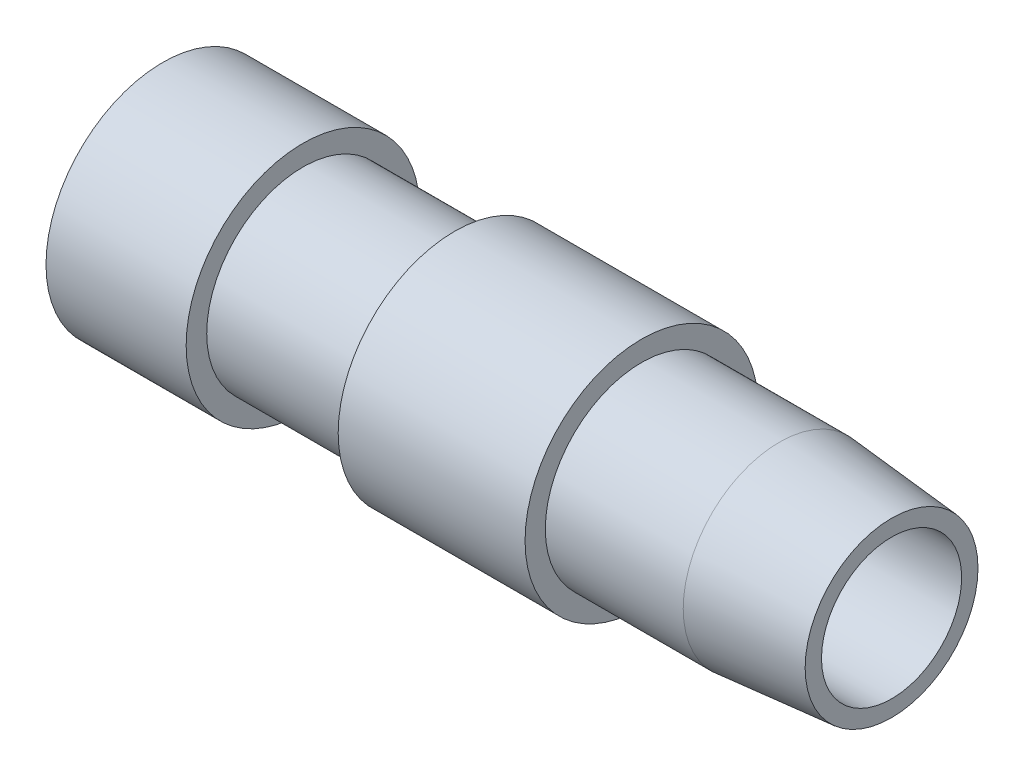
ISO-10303-21;
HEADER;
FILE_DESCRIPTION(('STEP AP214'),'2;1');
FILE_NAME('part.step','',(''),(''),'','','');
FILE_SCHEMA(('AUTOMOTIVE_DESIGN { 1 0 10303 214 1 1 1 1 }'));
ENDSEC;
DATA;
#1=APPLICATION_CONTEXT('core data for automotive mechanical design processes');
#2=APPLICATION_PROTOCOL_DEFINITION('international standard','automotive_design',2000,#1);
#3=PRODUCT_CONTEXT('',#1,'mechanical');
#4=PRODUCT('Part','Part','',(#3));
#5=PRODUCT_RELATED_PRODUCT_CATEGORY('part','',(#4));
#6=PRODUCT_DEFINITION_FORMATION('','',#4);
#7=PRODUCT_DEFINITION_CONTEXT('part definition',#1,'design');
#8=PRODUCT_DEFINITION('design','',#6,#7);
#9=PRODUCT_DEFINITION_SHAPE('','',#8);
#10=(LENGTH_UNIT() NAMED_UNIT(*) SI_UNIT(.MILLI.,.METRE.));
#11=(NAMED_UNIT(*) PLANE_ANGLE_UNIT() SI_UNIT($,.RADIAN.));
#12=(NAMED_UNIT(*) SI_UNIT($,.STERADIAN.) SOLID_ANGLE_UNIT());
#13=UNCERTAINTY_MEASURE_WITH_UNIT(LENGTH_MEASURE(1.E-05),#10,'distance_accuracy_value','');
#14=(GEOMETRIC_REPRESENTATION_CONTEXT(3) GLOBAL_UNCERTAINTY_ASSIGNED_CONTEXT((#13)) GLOBAL_UNIT_ASSIGNED_CONTEXT((#10,
#11,#12)) REPRESENTATION_CONTEXT('',''));
#15=CARTESIAN_POINT('',(0.,0.,0.));
#16=DIRECTION('',(0.,0.,1.));
#17=DIRECTION('',(1.,0.,0.));
#18=AXIS2_PLACEMENT_3D('',#15,#16,#17);
#19=CARTESIAN_POINT('',(0.,0.,0.));
#20=DIRECTION('',(-1.,0.,0.));
#21=DIRECTION('',(0.,0.,1.));
#22=AXIS2_PLACEMENT_3D('',#19,#20,#21);
#23=CYLINDRICAL_SURFACE('',#22,7.9375);
#24=CARTESIAN_POINT('',(0.,0.,0.));
#25=DIRECTION('',(-1.,0.,0.));
#26=DIRECTION('',(0.,0.,1.));
#27=AXIS2_PLACEMENT_3D('',#24,#25,#26);
#28=CIRCLE('',#27,7.9375);
#29=CARTESIAN_POINT('',(0.,0.,7.9375));
#30=VERTEX_POINT('',#29);
#31=EDGE_CURVE('E181',#30,#30,#28,.T.);
#32=ORIENTED_EDGE('',*,*,#31,.F.);
#33=EDGE_LOOP('',(#32));
#34=FACE_BOUND('',#33,.T.);
#35=CARTESIAN_POINT('',(9.525,0.,0.));
#36=DIRECTION('',(-1.,0.,0.));
#37=DIRECTION('',(0.,0.,1.));
#38=AXIS2_PLACEMENT_3D('',#35,#36,#37);
#39=CIRCLE('',#38,7.9375);
#40=CARTESIAN_POINT('',(9.525,0.,7.9375));
#41=VERTEX_POINT('',#40);
#42=EDGE_CURVE('E222',#41,#41,#39,.T.);
#43=ORIENTED_EDGE('',*,*,#42,.T.);
#44=EDGE_LOOP('',(#43));
#45=FACE_BOUND('',#44,.T.);
#46=ADVANCED_FACE('F44',(#34,#45),#23,.T.);
#47=CARTESIAN_POINT('',(9.525,7.9375,0.));
#48=DIRECTION('',(-1.,0.,0.));
#49=DIRECTION('',(0.,0.,1.));
#50=AXIS2_PLACEMENT_3D('',#47,#48,#49);
#51=PLANE('',#50);
#52=ORIENTED_EDGE('',*,*,#42,.F.);
#53=EDGE_LOOP('',(#52));
#54=FACE_BOUND('',#53,.T.);
#55=CARTESIAN_POINT('',(9.525,0.,0.));
#56=DIRECTION('',(-1.,0.,0.));
#57=DIRECTION('',(0.,0.,1.));
#58=AXIS2_PLACEMENT_3D('',#55,#56,#57);
#59=CIRCLE('',#58,6.5405);
#60=CARTESIAN_POINT('',(9.525,0.,6.5405));
#61=VERTEX_POINT('',#60);
#62=EDGE_CURVE('E218',#61,#61,#59,.T.);
#63=ORIENTED_EDGE('',*,*,#62,.T.);
#64=EDGE_LOOP('',(#63));
#65=FACE_BOUND('',#64,.T.);
#66=ADVANCED_FACE('F333',(#54,#65),#51,.F.);
#67=CARTESIAN_POINT('',(0.,0.,0.));
#68=DIRECTION('',(-1.,0.,0.));
#69=DIRECTION('',(0.,0.,1.));
#70=AXIS2_PLACEMENT_3D('',#67,#68,#69);
#71=CYLINDRICAL_SURFACE('',#70,6.5405);
#72=ORIENTED_EDGE('',*,*,#62,.F.);
#73=EDGE_LOOP('',(#72));
#74=FACE_BOUND('',#73,.T.);
#75=CARTESIAN_POINT('',(19.8374,0.,0.));
#76=DIRECTION('',(-1.,0.,0.));
#77=DIRECTION('',(0.,0.,1.));
#78=AXIS2_PLACEMENT_3D('',#75,#76,#77);
#79=CIRCLE('',#78,6.5405);
#80=CARTESIAN_POINT('',(19.8374,0.,6.5405));
#81=VERTEX_POINT('',#80);
#82=EDGE_CURVE('E214',#81,#81,#79,.T.);
#83=ORIENTED_EDGE('',*,*,#82,.T.);
#84=EDGE_LOOP('',(#83));
#85=FACE_BOUND('',#84,.T.);
#86=ADVANCED_FACE('F338',(#74,#85),#71,.T.);
#87=CARTESIAN_POINT('',(19.8374,6.5405,0.));
#88=DIRECTION('',(1.,0.,0.));
#89=DIRECTION('',(0.,0.,-1.));
#90=AXIS2_PLACEMENT_3D('',#87,#88,#89);
#91=PLANE('',#90);
#92=ORIENTED_EDGE('',*,*,#82,.F.);
#93=EDGE_LOOP('',(#92));
#94=FACE_BOUND('',#93,.T.);
#95=CARTESIAN_POINT('',(19.8374,0.,0.));
#96=DIRECTION('',(-1.,0.,0.));
#97=DIRECTION('',(0.,0.,1.));
#98=AXIS2_PLACEMENT_3D('',#95,#96,#97);
#99=CIRCLE('',#98,7.91718);
#100=CARTESIAN_POINT('',(19.8374,0.,7.91718));
#101=VERTEX_POINT('',#100);
#102=EDGE_CURVE('E210',#101,#101,#99,.T.);
#103=ORIENTED_EDGE('',*,*,#102,.T.);
#104=EDGE_LOOP('',(#103));
#105=FACE_BOUND('',#104,.T.);
#106=ADVANCED_FACE('F348',(#94,#105),#91,.F.);
#107=CARTESIAN_POINT('',(0.,0.,0.));
#108=DIRECTION('',(-1.,0.,0.));
#109=DIRECTION('',(0.,0.,1.));
#110=AXIS2_PLACEMENT_3D('',#107,#108,#109);
#111=CYLINDRICAL_SURFACE('',#110,7.91718);
#112=ORIENTED_EDGE('',*,*,#102,.F.);
#113=EDGE_LOOP('',(#112));
#114=FACE_BOUND('',#113,.T.);
#115=CARTESIAN_POINT('',(32.5374,0.,0.));
#116=DIRECTION('',(-1.,0.,0.));
#117=DIRECTION('',(0.,0.,1.));
#118=AXIS2_PLACEMENT_3D('',#115,#116,#117);
#119=CIRCLE('',#118,7.91718);
#120=CARTESIAN_POINT('',(32.5374,0.,7.91718));
#121=VERTEX_POINT('',#120);
#122=EDGE_CURVE('E206',#121,#121,#119,.T.);
#123=ORIENTED_EDGE('',*,*,#122,.T.);
#124=EDGE_LOOP('',(#123));
#125=FACE_BOUND('',#124,.T.);
#126=ADVANCED_FACE('F354',(#114,#125),#111,.T.);
#127=CARTESIAN_POINT('',(32.5374,7.91718,0.));
#128=DIRECTION('',(-1.,0.,0.));
#129=DIRECTION('',(0.,0.,1.));
#130=AXIS2_PLACEMENT_3D('',#127,#128,#129);
#131=PLANE('',#130);
#132=ORIENTED_EDGE('',*,*,#122,.F.);
#133=EDGE_LOOP('',(#132));
#134=FACE_BOUND('',#133,.T.);
#135=CARTESIAN_POINT('',(32.5374,0.,0.));
#136=DIRECTION('',(-1.,0.,0.));
#137=DIRECTION('',(0.,0.,1.));
#138=AXIS2_PLACEMENT_3D('',#135,#136,#137);
#139=CIRCLE('',#138,6.5405);
#140=CARTESIAN_POINT('',(32.5374,0.,6.5405));
#141=VERTEX_POINT('',#140);
#142=EDGE_CURVE('E202',#141,#141,#139,.T.);
#143=ORIENTED_EDGE('',*,*,#142,.T.);
#144=EDGE_LOOP('',(#143));
#145=FACE_BOUND('',#144,.T.);
#146=ADVANCED_FACE('F360',(#134,#145),#131,.F.);
#147=CARTESIAN_POINT('',(0.,0.,0.));
#148=DIRECTION('',(-1.,0.,0.));
#149=DIRECTION('',(0.,0.,1.));
#150=AXIS2_PLACEMENT_3D('',#147,#148,#149);
#151=CYLINDRICAL_SURFACE('',#150,6.5405);
#152=ORIENTED_EDGE('',*,*,#142,.F.);
#153=EDGE_LOOP('',(#152));
#154=FACE_BOUND('',#153,.T.);
#155=CARTESIAN_POINT('',(41.91,0.,0.));
#156=DIRECTION('',(-1.,0.,0.));
#157=DIRECTION('',(0.,0.,1.));
#158=AXIS2_PLACEMENT_3D('',#155,#156,#157);
#159=CIRCLE('',#158,6.5405);
#160=CARTESIAN_POINT('',(41.91,0.,6.5405));
#161=VERTEX_POINT('',#160);
#162=EDGE_CURVE('E198',#161,#161,#159,.T.);
#163=ORIENTED_EDGE('',*,*,#162,.T.);
#164=EDGE_LOOP('',(#163));
#165=FACE_BOUND('',#164,.T.);
#166=ADVANCED_FACE('F366',(#154,#165),#151,.T.);
#167=CARTESIAN_POINT('',(49.53,0.,0.));
#168=DIRECTION('',(-1.,0.,0.));
#169=DIRECTION('',(0.,0.,1.));
#170=AXIS2_PLACEMENT_3D('',#167,#168,#169);
#171=CONICAL_SURFACE('',#170,5.87383638393251,0.0872664625997096);
#172=ORIENTED_EDGE('',*,*,#162,.F.);
#173=EDGE_LOOP('',(#172));
#174=FACE_BOUND('',#173,.T.);
#175=CARTESIAN_POINT('',(49.53,0.,0.));
#176=DIRECTION('',(-1.,0.,0.));
#177=DIRECTION('',(0.,0.,1.));
#178=AXIS2_PLACEMENT_3D('',#175,#176,#177);
#179=CIRCLE('',#178,5.87383638393251);
#180=CARTESIAN_POINT('',(49.53,0.,5.87383638393251));
#181=VERTEX_POINT('',#180);
#182=EDGE_CURVE('E194',#181,#181,#179,.T.);
#183=ORIENTED_EDGE('',*,*,#182,.T.);
#184=EDGE_LOOP('',(#183));
#185=FACE_BOUND('',#184,.T.);
#186=ADVANCED_FACE('F372',(#174,#185),#171,.T.);
#187=CARTESIAN_POINT('',(49.53,5.87383638393251,0.));
#188=DIRECTION('',(-1.,0.,0.));
#189=DIRECTION('',(0.,0.,1.));
#190=AXIS2_PLACEMENT_3D('',#187,#188,#189);
#191=PLANE('',#190);
#192=ORIENTED_EDGE('',*,*,#182,.F.);
#193=EDGE_LOOP('',(#192));
#194=FACE_BOUND('',#193,.T.);
#195=CARTESIAN_POINT('',(49.53,0.,0.));
#196=DIRECTION('',(-1.,0.,0.));
#197=DIRECTION('',(0.,0.,1.));
#198=AXIS2_PLACEMENT_3D('',#195,#196,#197);
#199=CIRCLE('',#198,4.76250000000001);
#200=CARTESIAN_POINT('',(49.53,0.,4.76250000000001));
#201=VERTEX_POINT('',#200);
#202=EDGE_CURVE('E190',#201,#201,#199,.T.);
#203=ORIENTED_EDGE('',*,*,#202,.T.);
#204=EDGE_LOOP('',(#203));
#205=FACE_BOUND('',#204,.T.);
#206=ADVANCED_FACE('F378',(#194,#205),#191,.F.);
#207=CARTESIAN_POINT('',(0.,0.,0.));
#208=DIRECTION('',(-1.,0.,0.));
#209=DIRECTION('',(0.,0.,1.));
#210=AXIS2_PLACEMENT_3D('',#207,#208,#209);
#211=CYLINDRICAL_SURFACE('',#210,4.7625);
#212=CARTESIAN_POINT('',(3.175,0.,0.));
#213=DIRECTION('',(1.,0.,0.));
#214=DIRECTION('',(0.,0.,-1.));
#215=AXIS2_PLACEMENT_3D('',#212,#213,#214);
#216=CIRCLE('',#215,4.7625);
#217=CARTESIAN_POINT('',(3.175,-4.69588832783532,-0.79375));
#218=VERTEX_POINT('',#217);
#219=CARTESIAN_POINT('',(3.175,-4.69588832783532,0.79375));
#220=VERTEX_POINT('',#219);
#221=EDGE_CURVE('E11',#218,#220,#216,.F.);
#222=ORIENTED_EDGE('',*,*,#221,.T.);
#223=DIRECTION('',(-1.,0.,0.));
#224=VECTOR('',#223,1.);
#225=CARTESIAN_POINT('',(0.,-4.69588832783532,0.79375));
#226=LINE('',#225,#224);
#227=CARTESIAN_POINT('',(0.,-4.69588832783532,0.79375));
#228=VERTEX_POINT('',#227);
#229=EDGE_CURVE('E174',#220,#228,#226,.T.);
#230=ORIENTED_EDGE('',*,*,#229,.T.);
#231=CARTESIAN_POINT('',(0.,0.,0.));
#232=DIRECTION('',(-1.,0.,0.));
#233=DIRECTION('',(0.,0.,1.));
#234=AXIS2_PLACEMENT_3D('',#231,#232,#233);
#235=CIRCLE('',#234,4.7625);
#236=CARTESIAN_POINT('',(0.,4.69588832783532,0.79375));
#237=VERTEX_POINT('',#236);
#238=EDGE_CURVE('E185',#228,#237,#235,.T.);
#239=ORIENTED_EDGE('',*,*,#238,.T.);
#240=DIRECTION('',(-1.,0.,0.));
#241=VECTOR('',#240,1.);
#242=CARTESIAN_POINT('',(0.,4.69588832783532,0.79375));
#243=LINE('',#242,#241);
#244=CARTESIAN_POINT('',(3.175,4.69588832783532,0.79375));
#245=VERTEX_POINT('',#244);
#246=EDGE_CURVE('E178',#237,#245,#243,.F.);
#247=ORIENTED_EDGE('',*,*,#246,.T.);
#248=CARTESIAN_POINT('',(3.175,4.69588832783532,-0.79375));
#249=VERTEX_POINT('',#248);
#250=EDGE_CURVE('E47',#245,#249,#216,.F.);
#251=ORIENTED_EDGE('',*,*,#250,.T.);
#252=DIRECTION('',(-1.,0.,0.));
#253=VECTOR('',#252,1.);
#254=CARTESIAN_POINT('',(0.,4.69588832783532,-0.79375));
#255=LINE('',#254,#253);
#256=CARTESIAN_POINT('',(0.,4.69588832783532,-0.79375));
#257=VERTEX_POINT('',#256);
#258=EDGE_CURVE('E162',#249,#257,#255,.T.);
#259=ORIENTED_EDGE('',*,*,#258,.T.);
#260=CARTESIAN_POINT('',(0.,-4.69588832783532,-0.79375));
#261=VERTEX_POINT('',#260);
#262=EDGE_CURVE('E189',#257,#261,#235,.T.);
#263=ORIENTED_EDGE('',*,*,#262,.T.);
#264=DIRECTION('',(-1.,0.,0.));
#265=VECTOR('',#264,1.);
#266=CARTESIAN_POINT('',(0.,-4.69588832783532,-0.79375));
#267=LINE('',#266,#265);
#268=EDGE_CURVE('E67',#261,#218,#267,.F.);
#269=ORIENTED_EDGE('',*,*,#268,.T.);
#270=EDGE_LOOP('',(#222,#230,#239,#247,#251,#259,#263,#269));
#271=FACE_BOUND('',#270,.T.);
#272=ORIENTED_EDGE('',*,*,#202,.F.);
#273=EDGE_LOOP('',(#272));
#274=FACE_BOUND('',#273,.T.);
#275=ADVANCED_FACE('F237',(#271,#274),#211,.F.);
#276=CARTESIAN_POINT('',(0.,4.7625,0.));
#277=DIRECTION('',(1.,0.,0.));
#278=DIRECTION('',(0.,0.,-1.));
#279=AXIS2_PLACEMENT_3D('',#276,#277,#278);
#280=PLANE('',#279);
#281=ORIENTED_EDGE('',*,*,#238,.F.);
#282=DIRECTION('',(0.,1.,0.));
#283=VECTOR('',#282,1.);
#284=CARTESIAN_POINT('',(0.,-6.985,0.79375));
#285=LINE('',#284,#283);
#286=CARTESIAN_POINT('',(0.,-6.985,0.79375));
#287=VERTEX_POINT('',#286);
#288=EDGE_CURVE('E147',#287,#228,#285,.T.);
#289=ORIENTED_EDGE('',*,*,#288,.F.);
#290=DIRECTION('',(0.,0.,1.));
#291=VECTOR('',#290,1.);
#292=CARTESIAN_POINT('',(0.,-6.985,-0.79375));
#293=LINE('',#292,#291);
#294=CARTESIAN_POINT('',(0.,-6.985,-0.79375));
#295=VERTEX_POINT('',#294);
#296=EDGE_CURVE('E121',#295,#287,#293,.T.);
#297=ORIENTED_EDGE('',*,*,#296,.F.);
#298=DIRECTION('',(0.,1.,0.));
#299=VECTOR('',#298,1.);
#300=CARTESIAN_POINT('',(0.,4.7625,-0.79375));
#301=LINE('',#300,#299);
#302=EDGE_CURVE('E226',#295,#261,#301,.T.);
#303=ORIENTED_EDGE('',*,*,#302,.T.);
#304=ORIENTED_EDGE('',*,*,#262,.F.);
#305=DIRECTION('',(0.,-1.,0.));
#306=VECTOR('',#305,1.);
#307=CARTESIAN_POINT('',(0.,-6.985,-0.79375));
#308=LINE('',#307,#306);
#309=CARTESIAN_POINT('',(0.,6.985,-0.79375));
#310=VERTEX_POINT('',#309);
#311=EDGE_CURVE('E153',#310,#257,#308,.T.);
#312=ORIENTED_EDGE('',*,*,#311,.F.);
#313=DIRECTION('',(0.,0.,-1.));
#314=VECTOR('',#313,1.);
#315=CARTESIAN_POINT('',(0.,6.985,-0.79375));
#316=LINE('',#315,#314);
#317=CARTESIAN_POINT('',(0.,6.985,0.79375));
#318=VERTEX_POINT('',#317);
#319=EDGE_CURVE('E150',#318,#310,#316,.T.);
#320=ORIENTED_EDGE('',*,*,#319,.F.);
#321=DIRECTION('',(0.,-1.,0.));
#322=VECTOR('',#321,1.);
#323=CARTESIAN_POINT('',(0.,4.7625,0.79375));
#324=LINE('',#323,#322);
#325=EDGE_CURVE('E125',#318,#237,#324,.T.);
#326=ORIENTED_EDGE('',*,*,#325,.T.);
#327=EDGE_LOOP('',(#281,#289,#297,#303,#304,#312,#320,#326));
#328=FACE_BOUND('',#327,.T.);
#329=ORIENTED_EDGE('',*,*,#31,.T.);
#330=EDGE_LOOP('',(#329));
#331=FACE_BOUND('',#330,.T.);
#332=ADVANCED_FACE('F232',(#328,#331),#280,.F.);
#333=CARTESIAN_POINT('',(3.175,6.985,-0.79375));
#334=DIRECTION('',(0.,1.,0.));
#335=DIRECTION('',(0.,0.,1.));
#336=AXIS2_PLACEMENT_3D('',#333,#334,#335);
#337=PLANE('',#336);
#338=ORIENTED_EDGE('',*,*,#319,.T.);
#339=DIRECTION('',(-1.,0.,0.));
#340=VECTOR('',#339,1.);
#341=CARTESIAN_POINT('',(3.175,6.985,-0.79375));
#342=LINE('',#341,#340);
#343=CARTESIAN_POINT('',(3.175,6.985,-0.79375));
#344=VERTEX_POINT('',#343);
#345=EDGE_CURVE('E128',#344,#310,#342,.T.);
#346=ORIENTED_EDGE('',*,*,#345,.F.);
#347=DIRECTION('',(0.,0.,-1.));
#348=VECTOR('',#347,1.);
#349=CARTESIAN_POINT('',(3.175,6.985,-0.79375));
#350=LINE('',#349,#348);
#351=CARTESIAN_POINT('',(3.175,6.985,0.79375));
#352=VERTEX_POINT('',#351);
#353=EDGE_CURVE('E115',#352,#344,#350,.T.);
#354=ORIENTED_EDGE('',*,*,#353,.F.);
#355=DIRECTION('',(-1.,0.,0.));
#356=VECTOR('',#355,1.);
#357=CARTESIAN_POINT('',(3.175,6.985,0.79375));
#358=LINE('',#357,#356);
#359=EDGE_CURVE('E59',#352,#318,#358,.T.);
#360=ORIENTED_EDGE('',*,*,#359,.T.);
#361=EDGE_LOOP('',(#338,#346,#354,#360));
#362=FACE_BOUND('',#361,.T.);
#363=ADVANCED_FACE('F131',(#362),#337,.F.);
#364=CARTESIAN_POINT('',(3.175,-6.985,-0.79375));
#365=DIRECTION('',(0.,0.,-1.));
#366=DIRECTION('',(-1.,0.,0.));
#367=AXIS2_PLACEMENT_3D('',#364,#365,#366);
#368=PLANE('',#367);
#369=DIRECTION('',(0.,-1.,0.));
#370=VECTOR('',#369,1.);
#371=CARTESIAN_POINT('',(3.175,-6.985,-0.79375));
#372=LINE('',#371,#370);
#373=EDGE_CURVE('E139',#344,#249,#372,.T.);
#374=ORIENTED_EDGE('',*,*,#373,.F.);
#375=ORIENTED_EDGE('',*,*,#345,.T.);
#376=ORIENTED_EDGE('',*,*,#311,.T.);
#377=ORIENTED_EDGE('',*,*,#258,.F.);
#378=EDGE_LOOP('',(#374,#375,#376,#377));
#379=FACE_BOUND('',#378,.T.);
#380=ADVANCED_FACE('F320',(#379),#368,.F.);
#381=CARTESIAN_POINT('',(3.175,-6.985,0.79375));
#382=DIRECTION('',(0.,0.,1.));
#383=DIRECTION('',(1.,0.,0.));
#384=AXIS2_PLACEMENT_3D('',#381,#382,#383);
#385=PLANE('',#384);
#386=ORIENTED_EDGE('',*,*,#325,.F.);
#387=ORIENTED_EDGE('',*,*,#359,.F.);
#388=DIRECTION('',(0.,1.,0.));
#389=VECTOR('',#388,1.);
#390=CARTESIAN_POINT('',(3.175,-6.985,0.79375));
#391=LINE('',#390,#389);
#392=EDGE_CURVE('E112',#245,#352,#391,.T.);
#393=ORIENTED_EDGE('',*,*,#392,.F.);
#394=ORIENTED_EDGE('',*,*,#246,.F.);
#395=EDGE_LOOP('',(#386,#387,#393,#394));
#396=FACE_BOUND('',#395,.T.);
#397=ADVANCED_FACE('F123',(#396),#385,.F.);
#398=CARTESIAN_POINT('',(3.175,0.,0.));
#399=DIRECTION('',(1.,0.,0.));
#400=DIRECTION('',(0.,0.,-1.));
#401=AXIS2_PLACEMENT_3D('',#398,#399,#400);
#402=PLANE('',#401);
#403=ORIENTED_EDGE('',*,*,#392,.T.);
#404=ORIENTED_EDGE('',*,*,#353,.T.);
#405=ORIENTED_EDGE('',*,*,#373,.T.);
#406=ORIENTED_EDGE('',*,*,#250,.F.);
#407=EDGE_LOOP('',(#403,#404,#405,#406));
#408=FACE_BOUND('',#407,.T.);
#409=ADVANCED_FACE('F113',(#408),#402,.F.);
#410=CARTESIAN_POINT('',(3.175,-6.985,-0.79375));
#411=VERTEX_POINT('',#410);
#412=EDGE_CURVE('E134',#218,#411,#372,.T.);
#413=ORIENTED_EDGE('',*,*,#412,.T.);
#414=DIRECTION('',(0.,0.,1.));
#415=VECTOR('',#414,1.);
#416=CARTESIAN_POINT('',(3.175,-6.985,-0.79375));
#417=LINE('',#416,#415);
#418=CARTESIAN_POINT('',(3.175,-6.985,0.79375));
#419=VERTEX_POINT('',#418);
#420=EDGE_CURVE('E129',#411,#419,#417,.T.);
#421=ORIENTED_EDGE('',*,*,#420,.T.);
#422=EDGE_CURVE('E120',#419,#220,#391,.T.);
#423=ORIENTED_EDGE('',*,*,#422,.T.);
#424=ORIENTED_EDGE('',*,*,#221,.F.);
#425=EDGE_LOOP('',(#413,#421,#423,#424));
#426=FACE_BOUND('',#425,.T.);
#427=ADVANCED_FACE('F243',(#426),#402,.F.);
#428=ORIENTED_EDGE('',*,*,#422,.F.);
#429=DIRECTION('',(-1.,0.,0.));
#430=VECTOR('',#429,1.);
#431=CARTESIAN_POINT('',(3.175,-6.985,0.79375));
#432=LINE('',#431,#430);
#433=EDGE_CURVE('E159',#419,#287,#432,.T.);
#434=ORIENTED_EDGE('',*,*,#433,.T.);
#435=ORIENTED_EDGE('',*,*,#288,.T.);
#436=ORIENTED_EDGE('',*,*,#229,.F.);
#437=EDGE_LOOP('',(#428,#434,#435,#436));
#438=FACE_BOUND('',#437,.T.);
#439=ADVANCED_FACE('F241',(#438),#385,.F.);
#440=ORIENTED_EDGE('',*,*,#302,.F.);
#441=DIRECTION('',(-1.,0.,0.));
#442=VECTOR('',#441,1.);
#443=CARTESIAN_POINT('',(3.175,-6.985,-0.79375));
#444=LINE('',#443,#442);
#445=EDGE_CURVE('E163',#411,#295,#444,.T.);
#446=ORIENTED_EDGE('',*,*,#445,.F.);
#447=ORIENTED_EDGE('',*,*,#412,.F.);
#448=ORIENTED_EDGE('',*,*,#268,.F.);
#449=EDGE_LOOP('',(#440,#446,#447,#448));
#450=FACE_BOUND('',#449,.T.);
#451=ADVANCED_FACE('F323',(#450),#368,.F.);
#452=CARTESIAN_POINT('',(3.175,-6.985,-0.79375));
#453=DIRECTION('',(0.,-1.,0.));
#454=DIRECTION('',(0.,0.,-1.));
#455=AXIS2_PLACEMENT_3D('',#452,#453,#454);
#456=PLANE('',#455);
#457=ORIENTED_EDGE('',*,*,#296,.T.);
#458=ORIENTED_EDGE('',*,*,#433,.F.);
#459=ORIENTED_EDGE('',*,*,#420,.F.);
#460=ORIENTED_EDGE('',*,*,#445,.T.);
#461=EDGE_LOOP('',(#457,#458,#459,#460));
#462=FACE_BOUND('',#461,.T.);
#463=ADVANCED_FACE('F247',(#462),#456,.F.);
#464=CLOSED_SHELL('',(#46,#66,#86,#106,#126,#146,#166,#186,#206,#275,#332,#363,#380,#397,#409,
#427,#439,#451,#463));
#465=MANIFOLD_SOLID_BREP('B2',#464);
#466=ADVANCED_BREP_SHAPE_REPRESENTATION('',(#18,#465),#14);
#467=SHAPE_DEFINITION_REPRESENTATION(#9,#466);
ENDSEC;
END-ISO-10303-21;
